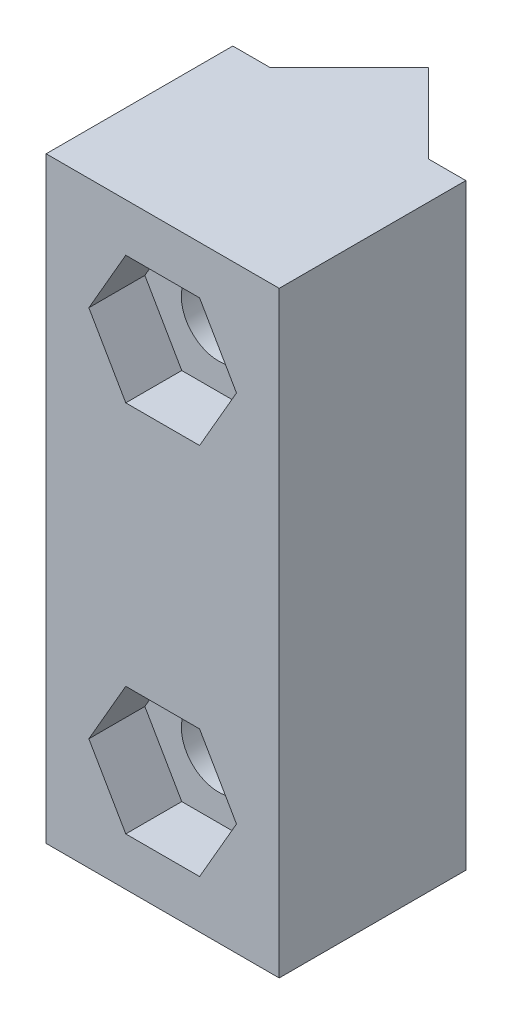
ISO-10303-21;
HEADER;
FILE_DESCRIPTION(('STEP AP214'),'2;1');
FILE_NAME('part.step','',(''),(''),'','','');
FILE_SCHEMA(('AUTOMOTIVE_DESIGN { 1 0 10303 214 1 1 1 1 }'));
ENDSEC;
DATA;
#1=APPLICATION_CONTEXT('core data for automotive mechanical design processes');
#2=APPLICATION_PROTOCOL_DEFINITION('international standard','automotive_design',2000,#1);
#3=PRODUCT_CONTEXT('',#1,'mechanical');
#4=PRODUCT('Part','Part','',(#3));
#5=PRODUCT_RELATED_PRODUCT_CATEGORY('part','',(#4));
#6=PRODUCT_DEFINITION_FORMATION('','',#4);
#7=PRODUCT_DEFINITION_CONTEXT('part definition',#1,'design');
#8=PRODUCT_DEFINITION('design','',#6,#7);
#9=PRODUCT_DEFINITION_SHAPE('','',#8);
#10=(LENGTH_UNIT() NAMED_UNIT(*) SI_UNIT(.MILLI.,.METRE.));
#11=(NAMED_UNIT(*) PLANE_ANGLE_UNIT() SI_UNIT($,.RADIAN.));
#12=(NAMED_UNIT(*) SI_UNIT($,.STERADIAN.) SOLID_ANGLE_UNIT());
#13=UNCERTAINTY_MEASURE_WITH_UNIT(LENGTH_MEASURE(1.E-05),#10,'distance_accuracy_value','');
#14=(GEOMETRIC_REPRESENTATION_CONTEXT(3) GLOBAL_UNCERTAINTY_ASSIGNED_CONTEXT((#13)) GLOBAL_UNIT_ASSIGNED_CONTEXT((#10,
#11,#12)) REPRESENTATION_CONTEXT('',''));
#15=CARTESIAN_POINT('',(0.,0.,0.));
#16=DIRECTION('',(0.,0.,1.));
#17=DIRECTION('',(1.,0.,0.));
#18=AXIS2_PLACEMENT_3D('',#15,#16,#17);
#19=CARTESIAN_POINT('',(1.25356138289862,-0.999999999999993,-15.));
#20=DIRECTION('',(0.,0.,1.));
#21=DIRECTION('',(1.,0.,0.));
#22=AXIS2_PLACEMENT_3D('',#19,#20,#21);
#23=CYLINDRICAL_SURFACE('',#22,2.);
#24=CARTESIAN_POINT('',(1.25356138289862,-0.999999999999993,-4.24264068711929));
#25=DIRECTION('',(-0.707106781186547,0.,0.707106781186548));
#26=DIRECTION('',(0.707106781186548,0.,0.707106781186547));
#27=AXIS2_PLACEMENT_3D('',#24,#25,#26);
#28=ELLIPSE('',#27,2.82842712474619,2.);
#29=CARTESIAN_POINT('',(1.25356138289862,-2.99999999999999,-4.24264068711928));
#30=VERTEX_POINT('',#29);
#31=CARTESIAN_POINT('',(1.25356138289862,1.00000000000001,-4.24264068711928));
#32=VERTEX_POINT('',#31);
#33=EDGE_CURVE('E55',#30,#32,#28,.T.);
#34=ORIENTED_EDGE('',*,*,#33,.F.);
#35=CARTESIAN_POINT('',(1.25356138289862,-0.999999999999993,-4.24264068711928));
#36=DIRECTION('',(0.707106781186547,0.,0.707106781186548));
#37=DIRECTION('',(-0.707106781186548,0.,0.707106781186547));
#38=AXIS2_PLACEMENT_3D('',#35,#36,#37);
#39=ELLIPSE('',#38,2.82842712474619,2.);
#40=EDGE_CURVE('E329',#32,#30,#39,.T.);
#41=ORIENTED_EDGE('',*,*,#40,.F.);
#42=EDGE_LOOP('',(#34,#41));
#43=FACE_BOUND('',#42,.T.);
#44=CARTESIAN_POINT('',(1.25356138289862,-0.999999999999993,7.));
#45=DIRECTION('',(0.,0.,1.));
#46=DIRECTION('',(1.,0.,0.));
#47=AXIS2_PLACEMENT_3D('',#44,#45,#46);
#48=CIRCLE('',#47,2.);
#49=CARTESIAN_POINT('',(3.25356138289862,-0.999999999999993,7.));
#50=VERTEX_POINT('',#49);
#51=EDGE_CURVE('E49',#50,#50,#48,.F.);
#52=ORIENTED_EDGE('',*,*,#51,.F.);
#53=EDGE_LOOP('',(#52));
#54=FACE_BOUND('',#53,.T.);
#55=ADVANCED_FACE('F45',(#43,#54),#23,.F.);
#56=CARTESIAN_POINT('',(7.4962020700179,-6.99999999999999,10.));
#57=DIRECTION('',(0.,0.,-1.));
#58=DIRECTION('',(-1.,0.,0.));
#59=AXIS2_PLACEMENT_3D('',#56,#57,#58);
#60=PLANE('',#59);
#61=DIRECTION('',(-0.5,0.866025403784439,0.));
#62=VECTOR('',#61,1.);
#63=CARTESIAN_POINT('',(5.20841072684756,-0.999999999999995,10.));
#64=LINE('',#63,#62);
#65=CARTESIAN_POINT('',(5.20841072684756,-0.999999999999995,10.));
#66=VERTEX_POINT('',#65);
#67=CARTESIAN_POINT('',(3.23098605487309,2.42500000000001,10.));
#68=VERTEX_POINT('',#67);
#69=EDGE_CURVE('E236',#66,#68,#64,.T.);
#70=ORIENTED_EDGE('',*,*,#69,.F.);
#71=DIRECTION('',(0.5,0.866025403784439,0.));
#72=VECTOR('',#71,1.);
#73=CARTESIAN_POINT('',(3.23098605487309,-4.42499999999999,10.));
#74=LINE('',#73,#72);
#75=CARTESIAN_POINT('',(3.23098605487309,-4.42499999999999,10.));
#76=VERTEX_POINT('',#75);
#77=EDGE_CURVE('E63',#76,#66,#74,.T.);
#78=ORIENTED_EDGE('',*,*,#77,.F.);
#79=DIRECTION('',(1.,0.,0.));
#80=VECTOR('',#79,1.);
#81=CARTESIAN_POINT('',(-0.723863289075851,-4.42499999999999,10.));
#82=LINE('',#81,#80);
#83=CARTESIAN_POINT('',(-0.723863289075851,-4.42499999999999,10.));
#84=VERTEX_POINT('',#83);
#85=EDGE_CURVE('E216',#84,#76,#82,.T.);
#86=ORIENTED_EDGE('',*,*,#85,.F.);
#87=DIRECTION('',(0.5,-0.866025403784438,0.));
#88=VECTOR('',#87,1.);
#89=CARTESIAN_POINT('',(-2.70128796105032,-0.999999999999991,10.));
#90=LINE('',#89,#88);
#91=CARTESIAN_POINT('',(-2.70128796105032,-0.999999999999991,10.));
#92=VERTEX_POINT('',#91);
#93=EDGE_CURVE('E220',#92,#84,#90,.T.);
#94=ORIENTED_EDGE('',*,*,#93,.F.);
#95=DIRECTION('',(-0.5,-0.866025403784438,0.));
#96=VECTOR('',#95,1.);
#97=CARTESIAN_POINT('',(-0.723863289075852,2.42500000000001,10.));
#98=LINE('',#97,#96);
#99=CARTESIAN_POINT('',(-0.723863289075852,2.42500000000001,10.));
#100=VERTEX_POINT('',#99);
#101=EDGE_CURVE('E243',#100,#92,#98,.T.);
#102=ORIENTED_EDGE('',*,*,#101,.F.);
#103=DIRECTION('',(-1.,0.,0.));
#104=VECTOR('',#103,1.);
#105=CARTESIAN_POINT('',(3.23098605487309,2.42500000000001,10.));
#106=LINE('',#105,#104);
#107=EDGE_CURVE('E239',#68,#100,#106,.T.);
#108=ORIENTED_EDGE('',*,*,#107,.F.);
#109=EDGE_LOOP('',(#70,#78,#86,#94,#102,#108));
#110=FACE_BOUND('',#109,.T.);
#111=DIRECTION('',(-0.5,-0.866025403784439,0.));
#112=VECTOR('',#111,1.);
#113=CARTESIAN_POINT('',(-2.70128796105032,19.,10.));
#114=LINE('',#113,#112);
#115=CARTESIAN_POINT('',(-0.723863289075852,22.425,10.));
#116=VERTEX_POINT('',#115);
#117=CARTESIAN_POINT('',(-2.70128796105032,19.,10.));
#118=VERTEX_POINT('',#117);
#119=EDGE_CURVE('E301',#116,#118,#114,.T.);
#120=ORIENTED_EDGE('',*,*,#119,.F.);
#121=DIRECTION('',(-1.,0.,0.));
#122=VECTOR('',#121,1.);
#123=CARTESIAN_POINT('',(-0.723863289075854,22.425,10.));
#124=LINE('',#123,#122);
#125=CARTESIAN_POINT('',(3.23098605487309,22.425,10.));
#126=VERTEX_POINT('',#125);
#127=EDGE_CURVE('E71',#126,#116,#124,.T.);
#128=ORIENTED_EDGE('',*,*,#127,.F.);
#129=DIRECTION('',(-0.500000000000001,0.866025403784438,0.));
#130=VECTOR('',#129,1.);
#131=CARTESIAN_POINT('',(3.23098605487309,22.425,10.));
#132=LINE('',#131,#130);
#133=CARTESIAN_POINT('',(5.20841072684756,19.,10.));
#134=VERTEX_POINT('',#133);
#135=EDGE_CURVE('E284',#134,#126,#132,.T.);
#136=ORIENTED_EDGE('',*,*,#135,.F.);
#137=DIRECTION('',(0.5,0.866025403784439,0.));
#138=VECTOR('',#137,1.);
#139=CARTESIAN_POINT('',(5.20841072684756,19.,10.));
#140=LINE('',#139,#138);
#141=CARTESIAN_POINT('',(3.23098605487308,15.575,10.));
#142=VERTEX_POINT('',#141);
#143=EDGE_CURVE('E288',#142,#134,#140,.T.);
#144=ORIENTED_EDGE('',*,*,#143,.F.);
#145=DIRECTION('',(1.,0.,0.));
#146=VECTOR('',#145,1.);
#147=CARTESIAN_POINT('',(3.23098605487308,15.575,10.));
#148=LINE('',#147,#146);
#149=CARTESIAN_POINT('',(-0.723863289075853,15.575,10.));
#150=VERTEX_POINT('',#149);
#151=EDGE_CURVE('E293',#150,#142,#148,.T.);
#152=ORIENTED_EDGE('',*,*,#151,.F.);
#153=DIRECTION('',(0.500000000000001,-0.866025403784438,0.));
#154=VECTOR('',#153,1.);
#155=CARTESIAN_POINT('',(-0.723863289075853,15.575,10.));
#156=LINE('',#155,#154);
#157=EDGE_CURVE('E297',#118,#150,#156,.T.);
#158=ORIENTED_EDGE('',*,*,#157,.F.);
#159=EDGE_LOOP('',(#120,#128,#136,#144,#152,#158));
#160=FACE_BOUND('',#159,.T.);
#161=DIRECTION('',(0.,1.,0.));
#162=VECTOR('',#161,1.);
#163=CARTESIAN_POINT('',(7.4962020700179,-6.99999999999999,10.));
#164=LINE('',#163,#162);
#165=CARTESIAN_POINT('',(7.4962020700179,-6.99999999999999,10.));
#166=VERTEX_POINT('',#165);
#167=CARTESIAN_POINT('',(7.4962020700179,25.,10.));
#168=VERTEX_POINT('',#167);
#169=EDGE_CURVE('E387',#166,#168,#164,.T.);
#170=ORIENTED_EDGE('',*,*,#169,.T.);
#171=DIRECTION('',(-1.,0.,0.));
#172=VECTOR('',#171,1.);
#173=CARTESIAN_POINT('',(7.4962020700179,25.,10.));
#174=LINE('',#173,#172);
#175=CARTESIAN_POINT('',(-4.98907930422067,25.,10.));
#176=VERTEX_POINT('',#175);
#177=EDGE_CURVE('E337',#168,#176,#174,.T.);
#178=ORIENTED_EDGE('',*,*,#177,.T.);
#179=DIRECTION('',(0.,1.,0.));
#180=VECTOR('',#179,1.);
#181=CARTESIAN_POINT('',(-4.98907930422067,-6.99999999999999,10.));
#182=LINE('',#181,#180);
#183=CARTESIAN_POINT('',(-4.98907930422067,-6.99999999999999,10.));
#184=VERTEX_POINT('',#183);
#185=EDGE_CURVE('E408',#184,#176,#182,.T.);
#186=ORIENTED_EDGE('',*,*,#185,.F.);
#187=DIRECTION('',(-1.,0.,0.));
#188=VECTOR('',#187,1.);
#189=CARTESIAN_POINT('',(7.4962020700179,-6.99999999999999,10.));
#190=LINE('',#189,#188);
#191=EDGE_CURVE('E365',#166,#184,#190,.T.);
#192=ORIENTED_EDGE('',*,*,#191,.F.);
#193=EDGE_LOOP('',(#170,#178,#186,#192));
#194=FACE_BOUND('',#193,.T.);
#195=ADVANCED_FACE('F47',(#110,#160,#194),#60,.F.);
#196=CARTESIAN_POINT('',(-4.98907930422067,-6.99999999999999,10.));
#197=DIRECTION('',(1.,0.,0.));
#198=DIRECTION('',(0.,0.,-1.));
#199=AXIS2_PLACEMENT_3D('',#196,#197,#198);
#200=PLANE('',#199);
#201=ORIENTED_EDGE('',*,*,#185,.T.);
#202=DIRECTION('',(0.,0.,-1.));
#203=VECTOR('',#202,1.);
#204=CARTESIAN_POINT('',(-4.98907930422067,25.,10.));
#205=LINE('',#204,#203);
#206=CARTESIAN_POINT('',(-4.98907930422067,25.,0.));
#207=VERTEX_POINT('',#206);
#208=EDGE_CURVE('E341',#176,#207,#205,.T.);
#209=ORIENTED_EDGE('',*,*,#208,.T.);
#210=DIRECTION('',(0.,1.,0.));
#211=VECTOR('',#210,1.);
#212=CARTESIAN_POINT('',(-4.98907930422067,-6.99999999999999,0.));
#213=LINE('',#212,#211);
#214=CARTESIAN_POINT('',(-4.98907930422067,-6.99999999999999,0.));
#215=VERTEX_POINT('',#214);
#216=EDGE_CURVE('E405',#215,#207,#213,.T.);
#217=ORIENTED_EDGE('',*,*,#216,.F.);
#218=DIRECTION('',(0.,0.,-1.));
#219=VECTOR('',#218,1.);
#220=CARTESIAN_POINT('',(-4.98907930422067,-6.99999999999999,10.));
#221=LINE('',#220,#219);
#222=EDGE_CURVE('E369',#184,#215,#221,.T.);
#223=ORIENTED_EDGE('',*,*,#222,.F.);
#224=EDGE_LOOP('',(#201,#209,#217,#223));
#225=FACE_BOUND('',#224,.T.);
#226=ADVANCED_FACE('F428',(#225),#200,.F.);
#227=CARTESIAN_POINT('',(-4.98907930422067,-6.99999999999999,0.));
#228=DIRECTION('',(0.,0.,1.));
#229=DIRECTION('',(1.,0.,0.));
#230=AXIS2_PLACEMENT_3D('',#227,#228,#229);
#231=PLANE('',#230);
#232=ORIENTED_EDGE('',*,*,#216,.T.);
#233=DIRECTION('',(1.,0.,0.));
#234=VECTOR('',#233,1.);
#235=CARTESIAN_POINT('',(-4.98907930422067,25.,0.));
#236=LINE('',#235,#234);
#237=CARTESIAN_POINT('',(-2.98907930422067,25.,0.));
#238=VERTEX_POINT('',#237);
#239=EDGE_CURVE('E345',#207,#238,#236,.T.);
#240=ORIENTED_EDGE('',*,*,#239,.T.);
#241=DIRECTION('',(0.,1.,0.));
#242=VECTOR('',#241,1.);
#243=CARTESIAN_POINT('',(-2.98907930422067,-6.99999999999999,0.));
#244=LINE('',#243,#242);
#245=CARTESIAN_POINT('',(-2.98907930422067,-6.99999999999999,0.));
#246=VERTEX_POINT('',#245);
#247=EDGE_CURVE('E401',#246,#238,#244,.T.);
#248=ORIENTED_EDGE('',*,*,#247,.F.);
#249=DIRECTION('',(1.,0.,0.));
#250=VECTOR('',#249,1.);
#251=CARTESIAN_POINT('',(-4.98907930422067,-6.99999999999999,0.));
#252=LINE('',#251,#250);
#253=EDGE_CURVE('E372',#215,#246,#252,.T.);
#254=ORIENTED_EDGE('',*,*,#253,.F.);
#255=EDGE_LOOP('',(#232,#240,#248,#254));
#256=FACE_BOUND('',#255,.T.);
#257=ADVANCED_FACE('F456',(#256),#231,.F.);
#258=CARTESIAN_POINT('',(-2.98907930422067,-6.99999999999999,0.));
#259=DIRECTION('',(0.707106781186547,0.,0.707106781186548));
#260=DIRECTION('',(0.707106781186548,0.,-0.707106781186547));
#261=AXIS2_PLACEMENT_3D('',#258,#259,#260);
#262=PLANE('',#261);
#263=DIRECTION('',(0.,1.,0.));
#264=VECTOR('',#263,1.);
#265=CARTESIAN_POINT('',(1.25356138289862,-6.99999999999999,-4.24264068711928));
#266=LINE('',#265,#264);
#267=CARTESIAN_POINT('',(1.25356138289862,21.,-4.24264068711928));
#268=VERTEX_POINT('',#267);
#269=CARTESIAN_POINT('',(1.25356138289862,25.,-4.24264068711928));
#270=VERTEX_POINT('',#269);
#271=EDGE_CURVE('E396',#268,#270,#266,.T.);
#272=ORIENTED_EDGE('',*,*,#271,.F.);
#273=CARTESIAN_POINT('',(1.25356138289862,19.,-4.24264068711928));
#274=DIRECTION('',(0.707106781186547,0.,0.707106781186548));
#275=DIRECTION('',(-0.707106781186548,0.,0.707106781186547));
#276=AXIS2_PLACEMENT_3D('',#273,#274,#275);
#277=ELLIPSE('',#276,2.82842712474619,2.);
#278=CARTESIAN_POINT('',(1.25356138289862,17.,-4.24264068711928));
#279=VERTEX_POINT('',#278);
#280=EDGE_CURVE('E333',#268,#279,#277,.T.);
#281=ORIENTED_EDGE('',*,*,#280,.T.);
#282=EDGE_CURVE('E402',#32,#279,#266,.T.);
#283=ORIENTED_EDGE('',*,*,#282,.F.);
#284=ORIENTED_EDGE('',*,*,#40,.T.);
#285=CARTESIAN_POINT('',(1.25356138289862,-6.99999999999999,-4.24264068711928));
#286=VERTEX_POINT('',#285);
#287=EDGE_CURVE('E397',#286,#30,#266,.T.);
#288=ORIENTED_EDGE('',*,*,#287,.F.);
#289=DIRECTION('',(0.707106781186548,0.,-0.707106781186547));
#290=VECTOR('',#289,1.);
#291=CARTESIAN_POINT('',(-2.98907930422067,-6.99999999999999,0.));
#292=LINE('',#291,#290);
#293=EDGE_CURVE('E375',#246,#286,#292,.T.);
#294=ORIENTED_EDGE('',*,*,#293,.F.);
#295=ORIENTED_EDGE('',*,*,#247,.T.);
#296=DIRECTION('',(0.707106781186548,0.,-0.707106781186547));
#297=VECTOR('',#296,1.);
#298=CARTESIAN_POINT('',(-2.98907930422067,25.,0.));
#299=LINE('',#298,#297);
#300=EDGE_CURVE('E349',#238,#270,#299,.T.);
#301=ORIENTED_EDGE('',*,*,#300,.T.);
#302=EDGE_LOOP('',(#272,#281,#283,#284,#288,#294,#295,#301));
#303=FACE_BOUND('',#302,.T.);
#304=ADVANCED_FACE('F452',(#303),#262,.F.);
#305=CARTESIAN_POINT('',(1.25356138289862,-6.99999999999999,-4.24264068711928));
#306=DIRECTION('',(-0.707106781186547,0.,0.707106781186548));
#307=DIRECTION('',(0.707106781186548,0.,0.707106781186547));
#308=AXIS2_PLACEMENT_3D('',#305,#306,#307);
#309=PLANE('',#308);
#310=ORIENTED_EDGE('',*,*,#282,.T.);
#311=CARTESIAN_POINT('',(1.25356138289862,19.,-4.24264068711929));
#312=DIRECTION('',(-0.707106781186547,0.,0.707106781186548));
#313=DIRECTION('',(0.707106781186548,0.,0.707106781186547));
#314=AXIS2_PLACEMENT_3D('',#311,#312,#313);
#315=ELLIPSE('',#314,2.82842712474619,2.);
#316=EDGE_CURVE('E11',#279,#268,#315,.T.);
#317=ORIENTED_EDGE('',*,*,#316,.T.);
#318=ORIENTED_EDGE('',*,*,#271,.T.);
#319=DIRECTION('',(0.707106781186548,0.,0.707106781186547));
#320=VECTOR('',#319,1.);
#321=CARTESIAN_POINT('',(1.25356138289862,25.,-4.24264068711928));
#322=LINE('',#321,#320);
#323=CARTESIAN_POINT('',(5.4962020700179,25.,0.));
#324=VERTEX_POINT('',#323);
#325=EDGE_CURVE('E353',#270,#324,#322,.T.);
#326=ORIENTED_EDGE('',*,*,#325,.T.);
#327=DIRECTION('',(0.,1.,0.));
#328=VECTOR('',#327,1.);
#329=CARTESIAN_POINT('',(5.4962020700179,-6.99999999999999,0.));
#330=LINE('',#329,#328);
#331=CARTESIAN_POINT('',(5.4962020700179,-6.99999999999999,0.));
#332=VERTEX_POINT('',#331);
#333=EDGE_CURVE('E393',#332,#324,#330,.T.);
#334=ORIENTED_EDGE('',*,*,#333,.F.);
#335=DIRECTION('',(0.707106781186548,0.,0.707106781186547));
#336=VECTOR('',#335,1.);
#337=CARTESIAN_POINT('',(1.25356138289862,-6.99999999999999,-4.24264068711928));
#338=LINE('',#337,#336);
#339=EDGE_CURVE('E378',#286,#332,#338,.T.);
#340=ORIENTED_EDGE('',*,*,#339,.F.);
#341=ORIENTED_EDGE('',*,*,#287,.T.);
#342=ORIENTED_EDGE('',*,*,#33,.T.);
#343=EDGE_LOOP('',(#310,#317,#318,#326,#334,#340,#341,#342));
#344=FACE_BOUND('',#343,.T.);
#345=ADVANCED_FACE('F449',(#344),#309,.F.);
#346=CARTESIAN_POINT('',(5.4962020700179,-6.99999999999999,0.));
#347=DIRECTION('',(0.,0.,1.));
#348=DIRECTION('',(1.,0.,0.));
#349=AXIS2_PLACEMENT_3D('',#346,#347,#348);
#350=PLANE('',#349);
#351=ORIENTED_EDGE('',*,*,#333,.T.);
#352=DIRECTION('',(1.,0.,0.));
#353=VECTOR('',#352,1.);
#354=CARTESIAN_POINT('',(5.4962020700179,25.,0.));
#355=LINE('',#354,#353);
#356=CARTESIAN_POINT('',(7.4962020700179,25.,0.));
#357=VERTEX_POINT('',#356);
#358=EDGE_CURVE('E357',#324,#357,#355,.T.);
#359=ORIENTED_EDGE('',*,*,#358,.T.);
#360=DIRECTION('',(0.,1.,0.));
#361=VECTOR('',#360,1.);
#362=CARTESIAN_POINT('',(7.4962020700179,-6.99999999999999,0.));
#363=LINE('',#362,#361);
#364=CARTESIAN_POINT('',(7.4962020700179,-6.99999999999999,0.));
#365=VERTEX_POINT('',#364);
#366=EDGE_CURVE('E390',#365,#357,#363,.T.);
#367=ORIENTED_EDGE('',*,*,#366,.F.);
#368=DIRECTION('',(1.,0.,0.));
#369=VECTOR('',#368,1.);
#370=CARTESIAN_POINT('',(5.4962020700179,-6.99999999999999,0.));
#371=LINE('',#370,#369);
#372=EDGE_CURVE('E381',#332,#365,#371,.T.);
#373=ORIENTED_EDGE('',*,*,#372,.F.);
#374=EDGE_LOOP('',(#351,#359,#367,#373));
#375=FACE_BOUND('',#374,.T.);
#376=ADVANCED_FACE('F445',(#375),#350,.F.);
#377=CARTESIAN_POINT('',(7.4962020700179,-6.99999999999999,0.));
#378=DIRECTION('',(-1.,0.,0.));
#379=DIRECTION('',(0.,0.,1.));
#380=AXIS2_PLACEMENT_3D('',#377,#378,#379);
#381=PLANE('',#380);
#382=ORIENTED_EDGE('',*,*,#366,.T.);
#383=DIRECTION('',(0.,0.,1.));
#384=VECTOR('',#383,1.);
#385=CARTESIAN_POINT('',(7.4962020700179,25.,0.));
#386=LINE('',#385,#384);
#387=EDGE_CURVE('E361',#357,#168,#386,.T.);
#388=ORIENTED_EDGE('',*,*,#387,.T.);
#389=ORIENTED_EDGE('',*,*,#169,.F.);
#390=DIRECTION('',(0.,0.,1.));
#391=VECTOR('',#390,1.);
#392=CARTESIAN_POINT('',(7.4962020700179,-6.99999999999999,0.));
#393=LINE('',#392,#391);
#394=EDGE_CURVE('E384',#365,#166,#393,.T.);
#395=ORIENTED_EDGE('',*,*,#394,.F.);
#396=EDGE_LOOP('',(#382,#388,#389,#395));
#397=FACE_BOUND('',#396,.T.);
#398=ADVANCED_FACE('F441',(#397),#381,.F.);
#399=CARTESIAN_POINT('',(0.,-6.99999999999999,0.));
#400=DIRECTION('',(0.,-1.,0.));
#401=DIRECTION('',(0.,0.,-1.));
#402=AXIS2_PLACEMENT_3D('',#399,#400,#401);
#403=PLANE('',#402);
#404=ORIENTED_EDGE('',*,*,#191,.T.);
#405=ORIENTED_EDGE('',*,*,#222,.T.);
#406=ORIENTED_EDGE('',*,*,#253,.T.);
#407=ORIENTED_EDGE('',*,*,#293,.T.);
#408=ORIENTED_EDGE('',*,*,#339,.T.);
#409=ORIENTED_EDGE('',*,*,#372,.T.);
#410=ORIENTED_EDGE('',*,*,#394,.T.);
#411=EDGE_LOOP('',(#404,#405,#406,#407,#408,#409,#410));
#412=FACE_BOUND('',#411,.T.);
#413=ADVANCED_FACE('F437',(#412),#403,.T.);
#414=CARTESIAN_POINT('',(0.,25.,0.));
#415=DIRECTION('',(0.,-1.,0.));
#416=DIRECTION('',(0.,0.,-1.));
#417=AXIS2_PLACEMENT_3D('',#414,#415,#416);
#418=PLANE('',#417);
#419=ORIENTED_EDGE('',*,*,#177,.F.);
#420=ORIENTED_EDGE('',*,*,#387,.F.);
#421=ORIENTED_EDGE('',*,*,#358,.F.);
#422=ORIENTED_EDGE('',*,*,#325,.F.);
#423=ORIENTED_EDGE('',*,*,#300,.F.);
#424=ORIENTED_EDGE('',*,*,#239,.F.);
#425=ORIENTED_EDGE('',*,*,#208,.F.);
#426=EDGE_LOOP('',(#419,#420,#421,#422,#423,#424,#425));
#427=FACE_BOUND('',#426,.T.);
#428=ADVANCED_FACE('F434',(#427),#418,.F.);
#429=CARTESIAN_POINT('',(1.25356138289862,19.,-15.));
#430=DIRECTION('',(0.,0.,1.));
#431=DIRECTION('',(1.,0.,0.));
#432=AXIS2_PLACEMENT_3D('',#429,#430,#431);
#433=CYLINDRICAL_SURFACE('',#432,2.);
#434=CARTESIAN_POINT('',(1.25356138289862,19.,7.));
#435=DIRECTION('',(0.,0.,-1.));
#436=DIRECTION('',(-1.,0.,0.));
#437=AXIS2_PLACEMENT_3D('',#434,#435,#436);
#438=CIRCLE('',#437,2.);
#439=CARTESIAN_POINT('',(-0.746438617101384,19.,7.));
#440=VERTEX_POINT('',#439);
#441=EDGE_CURVE('E253',#440,#440,#438,.F.);
#442=ORIENTED_EDGE('',*,*,#441,.T.);
#443=EDGE_LOOP('',(#442));
#444=FACE_BOUND('',#443,.T.);
#445=ORIENTED_EDGE('',*,*,#316,.F.);
#446=ORIENTED_EDGE('',*,*,#280,.F.);
#447=EDGE_LOOP('',(#445,#446));
#448=FACE_BOUND('',#447,.T.);
#449=ADVANCED_FACE('F432',(#444,#448),#433,.F.);
#450=CARTESIAN_POINT('',(0.,0.,7.));
#451=DIRECTION('',(0.,0.,-1.));
#452=DIRECTION('',(-1.,0.,0.));
#453=AXIS2_PLACEMENT_3D('',#450,#451,#452);
#454=PLANE('',#453);
#455=DIRECTION('',(-1.,0.,0.));
#456=VECTOR('',#455,1.);
#457=CARTESIAN_POINT('',(-0.723863289075854,22.425,7.));
#458=LINE('',#457,#456);
#459=CARTESIAN_POINT('',(3.23098605487309,22.425,7.));
#460=VERTEX_POINT('',#459);
#461=CARTESIAN_POINT('',(-0.723863289075854,22.425,7.));
#462=VERTEX_POINT('',#461);
#463=EDGE_CURVE('E289',#460,#462,#458,.T.);
#464=ORIENTED_EDGE('',*,*,#463,.T.);
#465=DIRECTION('',(-0.5,-0.866025403784439,0.));
#466=VECTOR('',#465,1.);
#467=CARTESIAN_POINT('',(-2.70128796105032,19.,7.));
#468=LINE('',#467,#466);
#469=CARTESIAN_POINT('',(-2.70128796105032,19.,7.));
#470=VERTEX_POINT('',#469);
#471=EDGE_CURVE('E322',#462,#470,#468,.T.);
#472=ORIENTED_EDGE('',*,*,#471,.T.);
#473=DIRECTION('',(0.500000000000001,-0.866025403784438,0.));
#474=VECTOR('',#473,1.);
#475=CARTESIAN_POINT('',(-0.723863289075853,15.575,7.));
#476=LINE('',#475,#474);
#477=CARTESIAN_POINT('',(-0.723863289075853,15.575,7.));
#478=VERTEX_POINT('',#477);
#479=EDGE_CURVE('E318',#470,#478,#476,.T.);
#480=ORIENTED_EDGE('',*,*,#479,.T.);
#481=DIRECTION('',(1.,0.,0.));
#482=VECTOR('',#481,1.);
#483=CARTESIAN_POINT('',(3.23098605487308,15.575,7.));
#484=LINE('',#483,#482);
#485=CARTESIAN_POINT('',(3.23098605487308,15.575,7.));
#486=VERTEX_POINT('',#485);
#487=EDGE_CURVE('E314',#478,#486,#484,.T.);
#488=ORIENTED_EDGE('',*,*,#487,.T.);
#489=DIRECTION('',(0.5,0.866025403784439,0.));
#490=VECTOR('',#489,1.);
#491=CARTESIAN_POINT('',(5.20841072684756,19.,7.));
#492=LINE('',#491,#490);
#493=CARTESIAN_POINT('',(5.20841072684756,19.,7.));
#494=VERTEX_POINT('',#493);
#495=EDGE_CURVE('E310',#486,#494,#492,.T.);
#496=ORIENTED_EDGE('',*,*,#495,.T.);
#497=DIRECTION('',(-0.500000000000001,0.866025403784438,0.));
#498=VECTOR('',#497,1.);
#499=CARTESIAN_POINT('',(3.23098605487309,22.425,7.));
#500=LINE('',#499,#498);
#501=EDGE_CURVE('E268',#494,#460,#500,.T.);
#502=ORIENTED_EDGE('',*,*,#501,.T.);
#503=EDGE_LOOP('',(#464,#472,#480,#488,#496,#502));
#504=FACE_BOUND('',#503,.T.);
#505=ORIENTED_EDGE('',*,*,#441,.F.);
#506=EDGE_LOOP('',(#505));
#507=FACE_BOUND('',#506,.T.);
#508=ADVANCED_FACE('F489',(#504,#507),#454,.F.);
#509=CARTESIAN_POINT('',(-0.723863289075854,22.425,7.));
#510=DIRECTION('',(0.,1.,0.));
#511=DIRECTION('',(0.,0.,1.));
#512=AXIS2_PLACEMENT_3D('',#509,#510,#511);
#513=PLANE('',#512);
#514=ORIENTED_EDGE('',*,*,#127,.T.);
#515=DIRECTION('',(0.,0.,1.));
#516=VECTOR('',#515,1.);
#517=CARTESIAN_POINT('',(-0.723863289075854,22.425,7.));
#518=LINE('',#517,#516);
#519=EDGE_CURVE('E265',#462,#116,#518,.T.);
#520=ORIENTED_EDGE('',*,*,#519,.F.);
#521=ORIENTED_EDGE('',*,*,#463,.F.);
#522=DIRECTION('',(0.,0.,1.));
#523=VECTOR('',#522,1.);
#524=CARTESIAN_POINT('',(3.23098605487309,22.425,7.));
#525=LINE('',#524,#523);
#526=EDGE_CURVE('E281',#460,#126,#525,.T.);
#527=ORIENTED_EDGE('',*,*,#526,.T.);
#528=EDGE_LOOP('',(#514,#520,#521,#527));
#529=FACE_BOUND('',#528,.T.);
#530=ADVANCED_FACE('F493',(#529),#513,.F.);
#531=CARTESIAN_POINT('',(3.23098605487309,22.425,7.));
#532=DIRECTION('',(0.866025403784438,0.500000000000001,0.));
#533=DIRECTION('',(-0.500000000000001,0.866025403784438,0.));
#534=AXIS2_PLACEMENT_3D('',#531,#532,#533);
#535=PLANE('',#534);
#536=ORIENTED_EDGE('',*,*,#135,.T.);
#537=ORIENTED_EDGE('',*,*,#526,.F.);
#538=ORIENTED_EDGE('',*,*,#501,.F.);
#539=DIRECTION('',(0.,0.,1.));
#540=VECTOR('',#539,1.);
#541=CARTESIAN_POINT('',(5.20841072684756,19.,7.));
#542=LINE('',#541,#540);
#543=EDGE_CURVE('E278',#494,#134,#542,.T.);
#544=ORIENTED_EDGE('',*,*,#543,.T.);
#545=EDGE_LOOP('',(#536,#537,#538,#544));
#546=FACE_BOUND('',#545,.T.);
#547=ADVANCED_FACE('F498',(#546),#535,.F.);
#548=CARTESIAN_POINT('',(5.20841072684756,19.,7.));
#549=DIRECTION('',(0.866025403784439,-0.5,0.));
#550=DIRECTION('',(0.5,0.866025403784439,0.));
#551=AXIS2_PLACEMENT_3D('',#548,#549,#550);
#552=PLANE('',#551);
#553=ORIENTED_EDGE('',*,*,#143,.T.);
#554=ORIENTED_EDGE('',*,*,#543,.F.);
#555=ORIENTED_EDGE('',*,*,#495,.F.);
#556=DIRECTION('',(0.,0.,1.));
#557=VECTOR('',#556,1.);
#558=CARTESIAN_POINT('',(3.23098605487308,15.575,7.));
#559=LINE('',#558,#557);
#560=EDGE_CURVE('E275',#486,#142,#559,.T.);
#561=ORIENTED_EDGE('',*,*,#560,.T.);
#562=EDGE_LOOP('',(#553,#554,#555,#561));
#563=FACE_BOUND('',#562,.T.);
#564=ADVANCED_FACE('F504',(#563),#552,.F.);
#565=CARTESIAN_POINT('',(3.23098605487308,15.575,7.));
#566=DIRECTION('',(0.,-1.,0.));
#567=DIRECTION('',(0.,0.,-1.));
#568=AXIS2_PLACEMENT_3D('',#565,#566,#567);
#569=PLANE('',#568);
#570=ORIENTED_EDGE('',*,*,#151,.T.);
#571=ORIENTED_EDGE('',*,*,#560,.F.);
#572=ORIENTED_EDGE('',*,*,#487,.F.);
#573=DIRECTION('',(0.,0.,1.));
#574=VECTOR('',#573,1.);
#575=CARTESIAN_POINT('',(-0.723863289075853,15.575,7.));
#576=LINE('',#575,#574);
#577=EDGE_CURVE('E272',#478,#150,#576,.T.);
#578=ORIENTED_EDGE('',*,*,#577,.T.);
#579=EDGE_LOOP('',(#570,#571,#572,#578));
#580=FACE_BOUND('',#579,.T.);
#581=ADVANCED_FACE('F508',(#580),#569,.F.);
#582=CARTESIAN_POINT('',(-0.723863289075853,15.575,7.));
#583=DIRECTION('',(-0.866025403784438,-0.500000000000001,0.));
#584=DIRECTION('',(0.500000000000001,-0.866025403784438,0.));
#585=AXIS2_PLACEMENT_3D('',#582,#583,#584);
#586=PLANE('',#585);
#587=ORIENTED_EDGE('',*,*,#157,.T.);
#588=ORIENTED_EDGE('',*,*,#577,.F.);
#589=ORIENTED_EDGE('',*,*,#479,.F.);
#590=DIRECTION('',(0.,0.,1.));
#591=VECTOR('',#590,1.);
#592=CARTESIAN_POINT('',(-2.70128796105032,19.,7.));
#593=LINE('',#592,#591);
#594=EDGE_CURVE('E269',#470,#118,#593,.T.);
#595=ORIENTED_EDGE('',*,*,#594,.T.);
#596=EDGE_LOOP('',(#587,#588,#589,#595));
#597=FACE_BOUND('',#596,.T.);
#598=ADVANCED_FACE('F512',(#597),#586,.F.);
#599=CARTESIAN_POINT('',(-2.70128796105032,19.,7.));
#600=DIRECTION('',(-0.866025403784439,0.5,0.));
#601=DIRECTION('',(-0.5,-0.866025403784439,0.));
#602=AXIS2_PLACEMENT_3D('',#599,#600,#601);
#603=PLANE('',#602);
#604=ORIENTED_EDGE('',*,*,#119,.T.);
#605=ORIENTED_EDGE('',*,*,#594,.F.);
#606=ORIENTED_EDGE('',*,*,#471,.F.);
#607=ORIENTED_EDGE('',*,*,#519,.T.);
#608=EDGE_LOOP('',(#604,#605,#606,#607));
#609=FACE_BOUND('',#608,.T.);
#610=ADVANCED_FACE('F516',(#609),#603,.F.);
#611=CARTESIAN_POINT('',(0.,0.,7.));
#612=DIRECTION('',(0.,0.,1.));
#613=DIRECTION('',(1.,0.,0.));
#614=AXIS2_PLACEMENT_3D('',#611,#612,#613);
#615=PLANE('',#614);
#616=DIRECTION('',(0.5,0.866025403784439,0.));
#617=VECTOR('',#616,1.);
#618=CARTESIAN_POINT('',(3.23098605487309,-4.42499999999999,7.));
#619=LINE('',#618,#617);
#620=CARTESIAN_POINT('',(3.23098605487309,-4.42499999999999,7.));
#621=VERTEX_POINT('',#620);
#622=CARTESIAN_POINT('',(5.20841072684756,-0.999999999999995,7.));
#623=VERTEX_POINT('',#622);
#624=EDGE_CURVE('E193',#621,#623,#619,.T.);
#625=ORIENTED_EDGE('',*,*,#624,.T.);
#626=DIRECTION('',(-0.5,0.866025403784439,0.));
#627=VECTOR('',#626,1.);
#628=CARTESIAN_POINT('',(5.20841072684756,-0.999999999999995,7.));
#629=LINE('',#628,#627);
#630=CARTESIAN_POINT('',(3.23098605487309,2.42500000000001,7.));
#631=VERTEX_POINT('',#630);
#632=EDGE_CURVE('E203',#623,#631,#629,.T.);
#633=ORIENTED_EDGE('',*,*,#632,.T.);
#634=DIRECTION('',(-1.,0.,0.));
#635=VECTOR('',#634,1.);
#636=CARTESIAN_POINT('',(3.23098605487309,2.42500000000001,7.));
#637=LINE('',#636,#635);
#638=CARTESIAN_POINT('',(-0.723863289075852,2.42500000000001,7.));
#639=VERTEX_POINT('',#638);
#640=EDGE_CURVE('E209',#631,#639,#637,.T.);
#641=ORIENTED_EDGE('',*,*,#640,.T.);
#642=DIRECTION('',(-0.5,-0.866025403784438,0.));
#643=VECTOR('',#642,1.);
#644=CARTESIAN_POINT('',(-0.723863289075852,2.42500000000001,7.));
#645=LINE('',#644,#643);
#646=CARTESIAN_POINT('',(-2.70128796105032,-0.999999999999991,7.));
#647=VERTEX_POINT('',#646);
#648=EDGE_CURVE('E225',#639,#647,#645,.T.);
#649=ORIENTED_EDGE('',*,*,#648,.T.);
#650=DIRECTION('',(0.5,-0.866025403784438,0.));
#651=VECTOR('',#650,1.);
#652=CARTESIAN_POINT('',(-2.70128796105032,-0.999999999999991,7.));
#653=LINE('',#652,#651);
#654=CARTESIAN_POINT('',(-0.723863289075851,-4.42499999999999,7.));
#655=VERTEX_POINT('',#654);
#656=EDGE_CURVE('E229',#647,#655,#653,.T.);
#657=ORIENTED_EDGE('',*,*,#656,.T.);
#658=DIRECTION('',(1.,0.,0.));
#659=VECTOR('',#658,1.);
#660=CARTESIAN_POINT('',(-0.723863289075851,-4.42499999999999,7.));
#661=LINE('',#660,#659);
#662=EDGE_CURVE('E200',#655,#621,#661,.T.);
#663=ORIENTED_EDGE('',*,*,#662,.T.);
#664=EDGE_LOOP('',(#625,#633,#641,#649,#657,#663));
#665=FACE_BOUND('',#664,.T.);
#666=ORIENTED_EDGE('',*,*,#51,.T.);
#667=EDGE_LOOP('',(#666));
#668=FACE_BOUND('',#667,.T.);
#669=ADVANCED_FACE('F211',(#665,#668),#615,.T.);
#670=CARTESIAN_POINT('',(3.23098605487309,-4.42499999999999,7.));
#671=DIRECTION('',(0.866025403784438,-0.5,0.));
#672=DIRECTION('',(0.5,0.866025403784439,0.));
#673=AXIS2_PLACEMENT_3D('',#670,#671,#672);
#674=PLANE('',#673);
#675=ORIENTED_EDGE('',*,*,#77,.T.);
#676=DIRECTION('',(0.,0.,1.));
#677=VECTOR('',#676,1.);
#678=CARTESIAN_POINT('',(5.20841072684756,-0.999999999999995,7.));
#679=LINE('',#678,#677);
#680=EDGE_CURVE('E189',#623,#66,#679,.T.);
#681=ORIENTED_EDGE('',*,*,#680,.F.);
#682=ORIENTED_EDGE('',*,*,#624,.F.);
#683=DIRECTION('',(0.,0.,1.));
#684=VECTOR('',#683,1.);
#685=CARTESIAN_POINT('',(3.23098605487309,-4.42499999999999,7.));
#686=LINE('',#685,#684);
#687=EDGE_CURVE('E250',#621,#76,#686,.T.);
#688=ORIENTED_EDGE('',*,*,#687,.T.);
#689=EDGE_LOOP('',(#675,#681,#682,#688));
#690=FACE_BOUND('',#689,.T.);
#691=ADVANCED_FACE('F191',(#690),#674,.F.);
#692=CARTESIAN_POINT('',(-0.723863289075851,-4.42499999999999,7.));
#693=DIRECTION('',(0.,-1.,0.));
#694=DIRECTION('',(0.,0.,-1.));
#695=AXIS2_PLACEMENT_3D('',#692,#693,#694);
#696=PLANE('',#695);
#697=ORIENTED_EDGE('',*,*,#85,.T.);
#698=ORIENTED_EDGE('',*,*,#687,.F.);
#699=ORIENTED_EDGE('',*,*,#662,.F.);
#700=DIRECTION('',(0.,0.,1.));
#701=VECTOR('',#700,1.);
#702=CARTESIAN_POINT('',(-0.723863289075851,-4.42499999999999,7.));
#703=LINE('',#702,#701);
#704=EDGE_CURVE('E254',#655,#84,#703,.T.);
#705=ORIENTED_EDGE('',*,*,#704,.T.);
#706=EDGE_LOOP('',(#697,#698,#699,#705));
#707=FACE_BOUND('',#706,.T.);
#708=ADVANCED_FACE('F523',(#707),#696,.F.);
#709=CARTESIAN_POINT('',(-2.70128796105032,-0.999999999999991,7.));
#710=DIRECTION('',(-0.866025403784439,-0.5,0.));
#711=DIRECTION('',(0.5,-0.866025403784439,0.));
#712=AXIS2_PLACEMENT_3D('',#709,#710,#711);
#713=PLANE('',#712);
#714=ORIENTED_EDGE('',*,*,#93,.T.);
#715=ORIENTED_EDGE('',*,*,#704,.F.);
#716=ORIENTED_EDGE('',*,*,#656,.F.);
#717=DIRECTION('',(0.,0.,1.));
#718=VECTOR('',#717,1.);
#719=CARTESIAN_POINT('',(-2.70128796105032,-0.999999999999991,7.));
#720=LINE('',#719,#718);
#721=EDGE_CURVE('E257',#647,#92,#720,.T.);
#722=ORIENTED_EDGE('',*,*,#721,.T.);
#723=EDGE_LOOP('',(#714,#715,#716,#722));
#724=FACE_BOUND('',#723,.T.);
#725=ADVANCED_FACE('F533',(#724),#713,.F.);
#726=CARTESIAN_POINT('',(-0.723863289075852,2.42500000000001,7.));
#727=DIRECTION('',(-0.866025403784439,0.5,0.));
#728=DIRECTION('',(-0.5,-0.866025403784439,0.));
#729=AXIS2_PLACEMENT_3D('',#726,#727,#728);
#730=PLANE('',#729);
#731=ORIENTED_EDGE('',*,*,#101,.T.);
#732=ORIENTED_EDGE('',*,*,#721,.F.);
#733=ORIENTED_EDGE('',*,*,#648,.F.);
#734=DIRECTION('',(0.,0.,1.));
#735=VECTOR('',#734,1.);
#736=CARTESIAN_POINT('',(-0.723863289075852,2.42500000000001,7.));
#737=LINE('',#736,#735);
#738=EDGE_CURVE('E260',#639,#100,#737,.T.);
#739=ORIENTED_EDGE('',*,*,#738,.T.);
#740=EDGE_LOOP('',(#731,#732,#733,#739));
#741=FACE_BOUND('',#740,.T.);
#742=ADVANCED_FACE('F529',(#741),#730,.F.);
#743=CARTESIAN_POINT('',(3.23098605487309,2.42500000000001,7.));
#744=DIRECTION('',(0.,1.,0.));
#745=DIRECTION('',(0.,0.,1.));
#746=AXIS2_PLACEMENT_3D('',#743,#744,#745);
#747=PLANE('',#746);
#748=ORIENTED_EDGE('',*,*,#107,.T.);
#749=ORIENTED_EDGE('',*,*,#738,.F.);
#750=ORIENTED_EDGE('',*,*,#640,.F.);
#751=DIRECTION('',(0.,0.,1.));
#752=VECTOR('',#751,1.);
#753=CARTESIAN_POINT('',(3.23098605487309,2.42500000000001,7.));
#754=LINE('',#753,#752);
#755=EDGE_CURVE('E199',#631,#68,#754,.T.);
#756=ORIENTED_EDGE('',*,*,#755,.T.);
#757=EDGE_LOOP('',(#748,#749,#750,#756));
#758=FACE_BOUND('',#757,.T.);
#759=ADVANCED_FACE('F526',(#758),#747,.F.);
#760=CARTESIAN_POINT('',(5.20841072684756,-0.999999999999995,7.));
#761=DIRECTION('',(0.866025403784438,0.5,0.));
#762=DIRECTION('',(-0.5,0.866025403784439,0.));
#763=AXIS2_PLACEMENT_3D('',#760,#761,#762);
#764=PLANE('',#763);
#765=ORIENTED_EDGE('',*,*,#69,.T.);
#766=ORIENTED_EDGE('',*,*,#755,.F.);
#767=ORIENTED_EDGE('',*,*,#632,.F.);
#768=ORIENTED_EDGE('',*,*,#680,.T.);
#769=EDGE_LOOP('',(#765,#766,#767,#768));
#770=FACE_BOUND('',#769,.T.);
#771=ADVANCED_FACE('F204',(#770),#764,.F.);
#772=CLOSED_SHELL('',(#55,#195,#226,#257,#304,#345,#376,#398,#413,#428,#449,#508,#530,#547,#564,
#581,#598,#610,#669,#691,#708,#725,#742,#759,#771));
#773=MANIFOLD_SOLID_BREP('B2',#772);
#774=ADVANCED_BREP_SHAPE_REPRESENTATION('',(#18,#773),#14);
#775=SHAPE_DEFINITION_REPRESENTATION(#9,#774);
ENDSEC;
END-ISO-10303-21;
